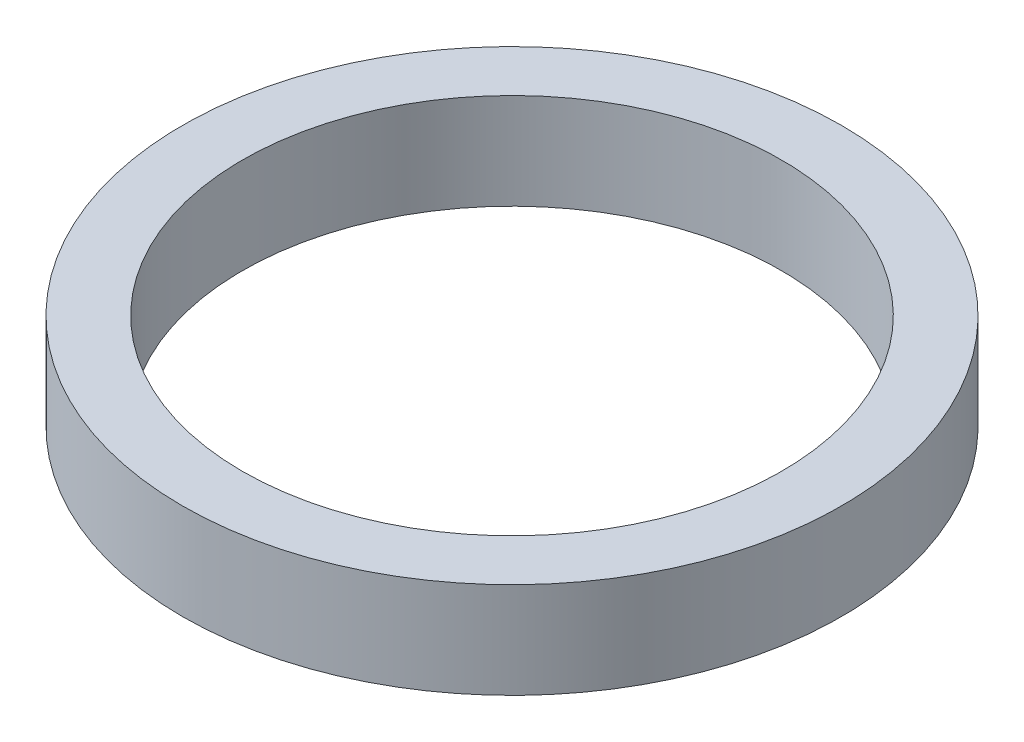
ISO-10303-21;
HEADER;
FILE_DESCRIPTION(('STEP AP214'),'2;1');
FILE_NAME('part.step','',(''),(''),'','','');
FILE_SCHEMA(('AUTOMOTIVE_DESIGN { 1 0 10303 214 1 1 1 1 }'));
ENDSEC;
DATA;
#1=APPLICATION_CONTEXT('core data for automotive mechanical design processes');
#2=APPLICATION_PROTOCOL_DEFINITION('international standard','automotive_design',2000,#1);
#3=PRODUCT_CONTEXT('',#1,'mechanical');
#4=PRODUCT('Part','Part','',(#3));
#5=PRODUCT_RELATED_PRODUCT_CATEGORY('part','',(#4));
#6=PRODUCT_DEFINITION_FORMATION('','',#4);
#7=PRODUCT_DEFINITION_CONTEXT('part definition',#1,'design');
#8=PRODUCT_DEFINITION('design','',#6,#7);
#9=PRODUCT_DEFINITION_SHAPE('','',#8);
#10=(LENGTH_UNIT() NAMED_UNIT(*) SI_UNIT(.MILLI.,.METRE.));
#11=(NAMED_UNIT(*) PLANE_ANGLE_UNIT() SI_UNIT($,.RADIAN.));
#12=(NAMED_UNIT(*) SI_UNIT($,.STERADIAN.) SOLID_ANGLE_UNIT());
#13=UNCERTAINTY_MEASURE_WITH_UNIT(LENGTH_MEASURE(1.E-05),#10,'distance_accuracy_value','');
#14=(GEOMETRIC_REPRESENTATION_CONTEXT(3) GLOBAL_UNCERTAINTY_ASSIGNED_CONTEXT((#13)) GLOBAL_UNIT_ASSIGNED_CONTEXT((#10,
#11,#12)) REPRESENTATION_CONTEXT('',''));
#15=CARTESIAN_POINT('',(0.,0.,0.));
#16=DIRECTION('',(0.,0.,1.));
#17=DIRECTION('',(1.,0.,0.));
#18=AXIS2_PLACEMENT_3D('',#15,#16,#17);
#19=CARTESIAN_POINT('',(0.,16.,0.));
#20=DIRECTION('',(0.,-1.,0.));
#21=DIRECTION('',(0.,0.,-1.));
#22=AXIS2_PLACEMENT_3D('',#19,#20,#21);
#23=CYLINDRICAL_SURFACE('',#22,55.);
#24=CARTESIAN_POINT('',(0.,16.,0.));
#25=DIRECTION('',(0.,1.,0.));
#26=DIRECTION('',(0.,0.,1.));
#27=AXIS2_PLACEMENT_3D('',#24,#25,#26);
#28=CIRCLE('',#27,55.);
#29=CARTESIAN_POINT('',(0.,16.,55.));
#30=VERTEX_POINT('',#29);
#31=EDGE_CURVE('E10',#30,#30,#28,.T.);
#32=ORIENTED_EDGE('',*,*,#31,.F.);
#33=EDGE_LOOP('',(#32));
#34=FACE_BOUND('',#33,.T.);
#35=CARTESIAN_POINT('',(0.,0.,0.));
#36=DIRECTION('',(0.,1.,0.));
#37=DIRECTION('',(0.,0.,1.));
#38=AXIS2_PLACEMENT_3D('',#35,#36,#37);
#39=CIRCLE('',#38,55.);
#40=CARTESIAN_POINT('',(0.,0.,55.));
#41=VERTEX_POINT('',#40);
#42=EDGE_CURVE('E37',#41,#41,#39,.T.);
#43=ORIENTED_EDGE('',*,*,#42,.T.);
#44=EDGE_LOOP('',(#43));
#45=FACE_BOUND('',#44,.T.);
#46=ADVANCED_FACE('F40',(#34,#45),#23,.T.);
#47=CARTESIAN_POINT('',(0.,16.,0.));
#48=DIRECTION('',(0.,1.,0.));
#49=DIRECTION('',(0.,0.,1.));
#50=AXIS2_PLACEMENT_3D('',#47,#48,#49);
#51=PLANE('',#50);
#52=CARTESIAN_POINT('',(0.,16.,0.));
#53=DIRECTION('',(0.,1.,0.));
#54=DIRECTION('',(0.,0.,1.));
#55=AXIS2_PLACEMENT_3D('',#52,#53,#54);
#56=CIRCLE('',#55,45.);
#57=CARTESIAN_POINT('',(0.,16.,45.));
#58=VERTEX_POINT('',#57);
#59=EDGE_CURVE('E50',#58,#58,#56,.T.);
#60=ORIENTED_EDGE('',*,*,#59,.F.);
#61=EDGE_LOOP('',(#60));
#62=FACE_BOUND('',#61,.T.);
#63=ORIENTED_EDGE('',*,*,#31,.T.);
#64=EDGE_LOOP('',(#63));
#65=FACE_BOUND('',#64,.T.);
#66=ADVANCED_FACE('F59',(#62,#65),#51,.T.);
#67=CARTESIAN_POINT('',(0.,0.,0.));
#68=DIRECTION('',(0.,1.,0.));
#69=DIRECTION('',(0.,0.,1.));
#70=AXIS2_PLACEMENT_3D('',#67,#68,#69);
#71=PLANE('',#70);
#72=CARTESIAN_POINT('',(0.,0.,0.));
#73=DIRECTION('',(0.,1.,0.));
#74=DIRECTION('',(0.,0.,1.));
#75=AXIS2_PLACEMENT_3D('',#72,#73,#74);
#76=CIRCLE('',#75,45.);
#77=CARTESIAN_POINT('',(0.,0.,45.));
#78=VERTEX_POINT('',#77);
#79=EDGE_CURVE('E47',#78,#78,#76,.T.);
#80=ORIENTED_EDGE('',*,*,#79,.T.);
#81=EDGE_LOOP('',(#80));
#82=FACE_BOUND('',#81,.T.);
#83=ORIENTED_EDGE('',*,*,#42,.F.);
#84=EDGE_LOOP('',(#83));
#85=FACE_BOUND('',#84,.T.);
#86=ADVANCED_FACE('F58',(#82,#85),#71,.F.);
#87=CARTESIAN_POINT('',(0.,16.,0.));
#88=DIRECTION('',(0.,-1.,0.));
#89=DIRECTION('',(0.,0.,-1.));
#90=AXIS2_PLACEMENT_3D('',#87,#88,#89);
#91=CYLINDRICAL_SURFACE('',#90,45.);
#92=ORIENTED_EDGE('',*,*,#59,.T.);
#93=EDGE_LOOP('',(#92));
#94=FACE_BOUND('',#93,.T.);
#95=ORIENTED_EDGE('',*,*,#79,.F.);
#96=EDGE_LOOP('',(#95));
#97=FACE_BOUND('',#96,.T.);
#98=ADVANCED_FACE('F54',(#94,#97),#91,.F.);
#99=CLOSED_SHELL('',(#46,#66,#86,#98));
#100=MANIFOLD_SOLID_BREP('B2',#99);
#101=ADVANCED_BREP_SHAPE_REPRESENTATION('',(#18,#100),#14);
#102=SHAPE_DEFINITION_REPRESENTATION(#9,#101);
ENDSEC;
END-ISO-10303-21;
